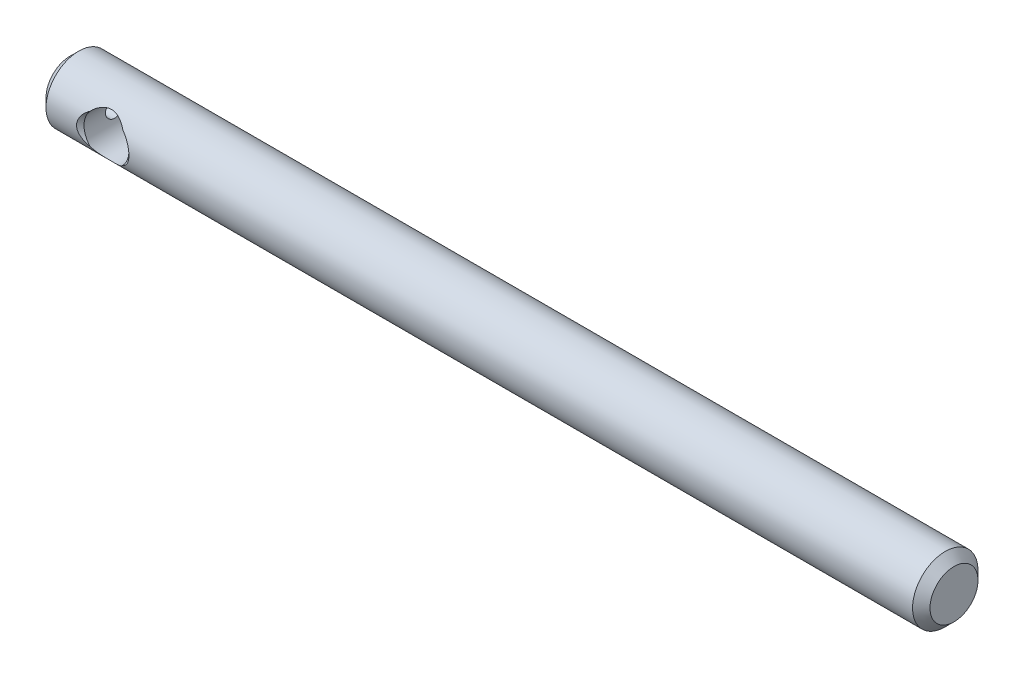
ISO-10303-21;
HEADER;
FILE_DESCRIPTION(('STEP AP214'),'2;1');
FILE_NAME('part.step','',(''),(''),'','','');
FILE_SCHEMA(('AUTOMOTIVE_DESIGN { 1 0 10303 214 1 1 1 1 }'));
ENDSEC;
DATA;
#1=APPLICATION_CONTEXT('core data for automotive mechanical design processes');
#2=APPLICATION_PROTOCOL_DEFINITION('international standard','automotive_design',2000,#1);
#3=PRODUCT_CONTEXT('',#1,'mechanical');
#4=PRODUCT('Part','Part','',(#3));
#5=PRODUCT_RELATED_PRODUCT_CATEGORY('part','',(#4));
#6=PRODUCT_DEFINITION_FORMATION('','',#4);
#7=PRODUCT_DEFINITION_CONTEXT('part definition',#1,'design');
#8=PRODUCT_DEFINITION('design','',#6,#7);
#9=PRODUCT_DEFINITION_SHAPE('','',#8);
#10=(LENGTH_UNIT() NAMED_UNIT(*) SI_UNIT(.MILLI.,.METRE.));
#11=(NAMED_UNIT(*) PLANE_ANGLE_UNIT() SI_UNIT($,.RADIAN.));
#12=(NAMED_UNIT(*) SI_UNIT($,.STERADIAN.) SOLID_ANGLE_UNIT());
#13=UNCERTAINTY_MEASURE_WITH_UNIT(LENGTH_MEASURE(1.E-05),#10,'distance_accuracy_value','');
#14=(GEOMETRIC_REPRESENTATION_CONTEXT(3) GLOBAL_UNCERTAINTY_ASSIGNED_CONTEXT((#13)) GLOBAL_UNIT_ASSIGNED_CONTEXT((#10,
#11,#12)) REPRESENTATION_CONTEXT('',''));
#15=CARTESIAN_POINT('',(0.,0.,0.));
#16=DIRECTION('',(0.,0.,1.));
#17=DIRECTION('',(1.,0.,0.));
#18=AXIS2_PLACEMENT_3D('',#15,#16,#17);
#19=CARTESIAN_POINT('',(0.,0.,0.));
#20=DIRECTION('',(1.,0.,0.));
#21=DIRECTION('',(0.,0.,-1.));
#22=AXIS2_PLACEMENT_3D('',#19,#20,#21);
#23=PLANE('',#22);
#24=CARTESIAN_POINT('',(0.,0.,0.));
#25=DIRECTION('',(1.,0.,0.));
#26=DIRECTION('',(0.,0.,-1.));
#27=AXIS2_PLACEMENT_3D('',#24,#25,#26);
#28=CIRCLE('',#27,3.49249999999994);
#29=CARTESIAN_POINT('',(0.,0.,-3.49249999999994));
#30=VERTEX_POINT('',#29);
#31=EDGE_CURVE('E172',#30,#30,#28,.F.);
#32=ORIENTED_EDGE('',*,*,#31,.T.);
#33=EDGE_LOOP('',(#32));
#34=FACE_BOUND('',#33,.T.);
#35=CARTESIAN_POINT('',(0.,0.,0.));
#36=DIRECTION('',(-1.,0.,0.));
#37=DIRECTION('',(0.,0.,1.));
#38=AXIS2_PLACEMENT_3D('',#35,#36,#37);
#39=CIRCLE('',#38,1.5875);
#40=CARTESIAN_POINT('',(0.,0.,1.5875));
#41=VERTEX_POINT('',#40);
#42=EDGE_CURVE('E200',#41,#41,#39,.T.);
#43=ORIENTED_EDGE('',*,*,#42,.F.);
#44=EDGE_LOOP('',(#43));
#45=FACE_BOUND('',#44,.T.);
#46=ADVANCED_FACE('F49',(#34,#45),#23,.F.);
#47=CARTESIAN_POINT('',(128.651,0.,0.));
#48=DIRECTION('',(-1.,0.,0.));
#49=DIRECTION('',(0.,0.,1.));
#50=AXIS2_PLACEMENT_3D('',#47,#48,#49);
#51=CYLINDRICAL_SURFACE('',#50,4.7625);
#52=CARTESIAN_POINT('',(11.922846100149,-2.21435708276691,4.2164));
#53=CARTESIAN_POINT('',(11.8593963851507,-2.28304575855669,4.18033580494722));
#54=CARTESIAN_POINT('',(11.7931871437269,-2.34883615391557,4.14363346204814));
#55=CARTESIAN_POINT('',(11.6554453977017,-2.47446195459834,4.06985668284569));
#56=CARTESIAN_POINT('',(11.5839096207442,-2.5342936455519,4.03278203011582));
#57=CARTESIAN_POINT('',(11.4350969839388,-2.64828872738355,3.95886769940015));
#58=CARTESIAN_POINT('',(11.3577726778384,-2.70239385670328,3.9220334640076));
#59=CARTESIAN_POINT('',(11.1982081699457,-2.8039907225802,3.85005466405678));
#60=CARTESIAN_POINT('',(11.1159695326934,-2.8514845480667,3.81490956810091));
#61=CARTESIAN_POINT('',(10.8950216081164,-2.96642689913845,3.72688443656107));
#62=CARTESIAN_POINT('',(10.7524574221086,-3.0283829611826,3.67625853365449));
#63=CARTESIAN_POINT('',(10.4567130929824,-3.13198686833555,3.58841407943456));
#64=CARTESIAN_POINT('',(10.3035781811195,-3.17371577420326,3.55114217113978));
#65=CARTESIAN_POINT('',(10.0141619889141,-3.22984934359262,3.50009990107455));
#66=CARTESIAN_POINT('',(9.87901968747151,-3.24752005023514,3.48355460221914));
#67=CARTESIAN_POINT('',(9.60657372860572,-3.26573038577451,3.46649530677007));
#68=CARTESIAN_POINT('',(9.46927106408931,-3.26627766706759,3.46597414904808));
#69=CARTESIAN_POINT('',(9.19682812196039,-3.25022392482608,3.48102751074769));
#70=CARTESIAN_POINT('',(9.0616848719643,-3.23364899276646,3.49657754030484));
#71=CARTESIAN_POINT('',(8.79664575810681,-3.18445797875663,3.54142841472073));
#72=CARTESIAN_POINT('',(8.66675786427301,-3.15181845318272,3.57074935307867));
#73=CARTESIAN_POINT('',(8.36988486157737,-3.05791246355705,3.65179836609711));
#74=CARTESIAN_POINT('',(8.20599065514899,-2.99060776470707,3.70778253889326));
#75=CARTESIAN_POINT('',(7.89398142893566,-2.83257936795664,3.8298640806536));
#76=CARTESIAN_POINT('',(7.74589118136443,-2.74181964529525,3.89597694218302));
#77=CARTESIAN_POINT('',(7.51947782700501,-2.57729539988316,4.00558776091318));
#78=CARTESIAN_POINT('',(7.43590920361209,-2.51003404771525,4.04820927783652));
#79=CARTESIAN_POINT('',(7.2761055379004,-2.36788121999423,4.13296225373637));
#80=CARTESIAN_POINT('',(7.19983689581187,-2.29302832970382,4.1750950869016));
#81=CARTESIAN_POINT('',(7.12715389985095,-2.21435708276691,4.2164));
#82=B_SPLINE_CURVE_WITH_KNOTS('',3,(#52,#53,#54,#55,#56,#57,#58,#59,#60,#61,#62,#63,#64,#65,#66,
#67,#68,#69,#70,#71,#72,#73,#74,#75,#76,#77,#78,#79,#80,#81),.UNSPECIFIED.,.F.,.F.,(4,2,2,2,2,2,
2,2,2,2,2,2,2,2,4),(0.,0.30057240666838,0.601331018188819,0.904903154712081,1.20837915480768,
1.6969146102825,2.1834757218994,2.59348533853288,3.00331172074826,3.41251451397409,
3.82231624972983,4.37678564380587,4.93211176632249,5.27796368440854,5.62213834558137),.UNSPECIFIED.);
#83=CARTESIAN_POINT('',(11.922846100149,-2.21435708276691,4.2164));
#84=VERTEX_POINT('',#83);
#85=CARTESIAN_POINT('',(7.12715389985095,-2.21435708276691,4.2164));
#86=VERTEX_POINT('',#85);
#87=EDGE_CURVE('E101',#84,#86,#82,.T.);
#88=ORIENTED_EDGE('',*,*,#87,.T.);
#89=CARTESIAN_POINT('',(8.90757793853357,-2.81914662962223,3.83846564797571));
#90=CARTESIAN_POINT('',(8.79106740837645,-2.80458060113342,3.84916390603148));
#91=CARTESIAN_POINT('',(8.67533703470588,-2.78588297248307,3.86277846865469));
#92=CARTESIAN_POINT('',(8.44622825969552,-2.74031671091774,3.8952330065565));
#93=CARTESIAN_POINT('',(8.3328511080855,-2.71344384926923,3.91407568569393));
#94=CARTESIAN_POINT('',(7.99694763086625,-2.62055560858735,3.97741141491382));
#95=CARTESIAN_POINT('',(7.77885777943836,-2.54229650322739,4.02869079786512));
#96=CARTESIAN_POINT('',(7.46351553749657,-2.39974217386415,4.11409056533092));
#97=CARTESIAN_POINT('',(7.35952397548273,-2.34746737269439,4.14426830402653));
#98=CARTESIAN_POINT('',(7.15687636592087,-2.23430226258242,4.20636113425489));
#99=CARTESIAN_POINT('',(7.05822152628604,-2.17341001435274,4.23827661585536));
#100=CARTESIAN_POINT('',(6.77209411130946,-1.97768848673568,4.33489664545605));
#101=CARTESIAN_POINT('',(6.5936079779569,-1.82944034695805,4.40071794104129));
#102=CARTESIAN_POINT('',(6.33713931074353,-1.56247172989335,4.50016282500026));
#103=CARTESIAN_POINT('',(6.24752318654744,-1.45568108484586,4.53612921876383));
#104=CARTESIAN_POINT('',(6.08497138494224,-1.22856593954547,4.60282274944209));
#105=CARTESIAN_POINT('',(6.0120090309261,-1.10826355080747,4.63355824501669));
#106=CARTESIAN_POINT('',(5.89809020529109,-0.877231583937831,4.68223131262798));
#107=CARTESIAN_POINT('',(5.853781718418,-0.768440236869561,4.70146262264769));
#108=CARTESIAN_POINT('',(5.78243845239669,-0.544300982720532,4.73264229237658));
#109=CARTESIAN_POINT('',(5.75539132106028,-0.428957828611541,4.74459585974));
#110=CARTESIAN_POINT('',(5.72060216568277,-0.194165580145159,4.75999999669277));
#111=CARTESIAN_POINT('',(5.71296044508726,-0.0746983748402494,4.76340638622127));
#112=CARTESIAN_POINT('',(5.71797557157861,0.163717889211004,4.76117762183344));
#113=CARTESIAN_POINT('',(5.73063180905551,0.282666963410834,4.75554273945426));
#114=CARTESIAN_POINT('',(5.77328621202589,0.506642394534393,4.73670144483795));
#115=CARTESIAN_POINT('',(5.80179657943709,0.612016048940199,4.72414532513178));
#116=CARTESIAN_POINT('',(5.87311942296365,0.816825624490935,4.69307488508336));
#117=CARTESIAN_POINT('',(5.91593753983042,0.916259185533052,4.67455821493265));
#118=CARTESIAN_POINT('',(6.03400836995725,1.14759495686977,4.62424700602127));
#119=CARTESIAN_POINT('',(6.11534935915909,1.27588361667324,4.59012965167193));
#120=CARTESIAN_POINT('',(6.29672297826325,1.51670150530158,4.51630179636163));
#121=CARTESIAN_POINT('',(6.39679943204449,1.62919268016438,4.47657823674379));
#122=CARTESIAN_POINT('',(6.65209880612282,1.87835759457933,4.37918572779586));
#123=CARTESIAN_POINT('',(6.81381476410978,2.00794308789971,4.32044038693387));
#124=CARTESIAN_POINT('',(7.15687624821052,2.23893097232324,4.20538424922484));
#125=CARTESIAN_POINT('',(7.33824461336457,2.34030007297322,4.14907639374711));
#126=CARTESIAN_POINT('',(7.72070357060016,2.51830974331137,4.04357535132911));
#127=CARTESIAN_POINT('',(7.92217513003681,2.59426519205241,3.99459640755657));
#128=CARTESIAN_POINT('',(8.23268035887299,2.68702803363707,3.93225727132933));
#129=CARTESIAN_POINT('',(8.33757458020784,2.7144220558186,3.91333127567738));
#130=CARTESIAN_POINT('',(8.54963098316964,2.76212318481161,3.87981168617045));
#131=CARTESIAN_POINT('',(8.65679237385253,2.78243272130545,3.86521660724906));
#132=CARTESIAN_POINT('',(8.88331999646291,2.81753165313805,3.83971873400111));
#133=CARTESIAN_POINT('',(9.00285683887617,2.8315890493981,3.82931517692259));
#134=CARTESIAN_POINT('',(9.24302714700901,2.85100028030227,3.81488546901932));
#135=CARTESIAN_POINT('',(9.3636606658709,2.85635369088717,3.81085962891794));
#136=CARTESIAN_POINT('',(9.60501575211909,2.85831566543433,3.80938834262644));
#137=CARTESIAN_POINT('',(9.7257372971171,2.8549259751524,3.81194158277557));
#138=CARTESIAN_POINT('',(9.96630000042284,2.83943170575494,3.82349655839155));
#139=CARTESIAN_POINT('',(10.0861411910958,2.82732744865673,3.83249805558484));
#140=CARTESIAN_POINT('',(10.3166621079365,2.79549786829503,3.8557697760723));
#141=CARTESIAN_POINT('',(10.4274500066965,2.77629024536124,3.86967967068664));
#142=CARTESIAN_POINT('',(10.6467604038374,2.73035429564902,3.90222427188532));
#143=CARTESIAN_POINT('',(10.7552818911146,2.70362268609715,3.92086104048951));
#144=CARTESIAN_POINT('',(11.0768290126512,2.61213165633669,3.98292372741341));
#145=CARTESIAN_POINT('',(11.2856634726761,2.5360999056252,4.03248272704616));
#146=CARTESIAN_POINT('',(11.5925844214243,2.39678067578893,4.11582093900066));
#147=CARTESIAN_POINT('',(11.6966870572993,2.3442327321016,4.14610371473533));
#148=CARTESIAN_POINT('',(11.8995173006829,2.23048291854163,4.20839218400429));
#149=CARTESIAN_POINT('',(11.9982435295559,2.16927884337318,4.24039831530171));
#150=CARTESIAN_POINT('',(12.2845380757109,1.97254043417229,4.33726470574129));
#151=CARTESIAN_POINT('',(12.4630491692057,1.82351489907142,4.40320997069355));
#152=CARTESIAN_POINT('',(12.7187932611042,1.55566445738261,4.5025195207368));
#153=CARTESIAN_POINT('',(12.8078396242737,1.4488926666274,4.5382990572157));
#154=CARTESIAN_POINT('',(12.9692628028756,1.22190566137549,4.60459225022133));
#155=CARTESIAN_POINT('',(13.0416667613823,1.10171281876056,4.63511446055254));
#156=CARTESIAN_POINT('',(13.1546781962743,0.870825550170116,4.6834267208862));
#157=CARTESIAN_POINT('',(13.1986097839898,0.762039924801345,4.70250279733239));
#158=CARTESIAN_POINT('',(13.2692003865232,0.537977449583431,4.73336387632051));
#159=CARTESIAN_POINT('',(13.2958716017266,0.422705247512862,4.7451540286055));
#160=CARTESIAN_POINT('',(13.3299345428874,0.188140495830151,4.76023879068693));
#161=CARTESIAN_POINT('',(13.3372278280879,0.068830524925416,4.76349002141992));
#162=CARTESIAN_POINT('',(13.331582049552,-0.169207882154685,4.76098106030375));
#163=CARTESIAN_POINT('',(13.318643341407,-0.287936328513958,4.75522102683382));
#164=CARTESIAN_POINT('',(13.2754969117669,-0.511620188089974,4.73616533163596));
#165=CARTESIAN_POINT('',(13.2467454336742,-0.616919745613378,4.72350584857322));
#166=CARTESIAN_POINT('',(13.1749722166696,-0.821552794991215,4.69224806523511));
#167=CARTESIAN_POINT('',(13.1319448515808,-0.920883916406098,4.67364742363645));
#168=CARTESIAN_POINT('',(13.0132687801218,-1.1522282140502,4.62309922599926));
#169=CARTESIAN_POINT('',(12.9314993371839,-1.2805914267425,4.58882070386572));
#170=CARTESIAN_POINT('',(12.7492584149673,-1.52148939088488,4.51469336897146));
#171=CARTESIAN_POINT('',(12.6487429468235,-1.63398579628532,4.4748315104499));
#172=CARTESIAN_POINT('',(12.3924292528058,-1.88306236961289,4.37716454318029));
#173=CARTESIAN_POINT('',(12.2301428005514,-2.01253596574607,4.31829985237851));
#174=CARTESIAN_POINT('',(11.8859411351527,-2.2432208347712,4.20309434479735));
#175=CARTESIAN_POINT('',(11.7040028323141,-2.3443983496349,4.1467566094266));
#176=CARTESIAN_POINT('',(11.3204184945204,-2.52191858675782,4.04131956194357));
#177=CARTESIAN_POINT('',(11.1183936299493,-2.5975776320534,3.99243627726741));
#178=CARTESIAN_POINT('',(10.8070977008541,-2.68981615681758,3.93034869484701));
#179=CARTESIAN_POINT('',(10.7019541533932,-2.71702093083074,3.91152550741485));
#180=CARTESIAN_POINT('',(10.4894123134842,-2.76431879076288,3.87824598167919));
#181=CARTESIAN_POINT('',(10.3820148561514,-2.78441446312235,3.86378805548305));
#182=CARTESIAN_POINT('',(10.1613506831524,-2.81807213336412,3.83931324398566));
#183=CARTESIAN_POINT('',(10.0480185578867,-2.83134830135868,3.82949185985154));
#184=CARTESIAN_POINT('',(9.82035577277732,-2.85007829359716,3.81557300902968));
#185=CARTESIAN_POINT('',(9.7060251102109,-2.85553209650423,3.81147555795495));
#186=CARTESIAN_POINT('',(9.47721299593673,-2.85858033142155,3.80919004033268));
#187=CARTESIAN_POINT('',(9.36273156499871,-2.85617575166524,3.81100123074197));
#188=CARTESIAN_POINT('',(9.13444781483653,-2.84352679120398,3.82044790594498));
#189=CARTESIAN_POINT('',(9.02064551190753,-2.83328222314073,3.82808352992971));
#190=CARTESIAN_POINT('',(8.90757793853357,-2.81914662962223,3.83846564797571));
#191=B_SPLINE_CURVE_WITH_KNOTS('',3,(#89,#90,#91,#92,#93,#94,#95,#96,#97,#98,#99,#100,#101,#102,
#103,#104,#105,#106,#107,#108,#109,#110,#111,#112,#113,#114,#115,#116,#117,#118,#119,#120,#121,
#122,#123,#124,#125,#126,#127,#128,#129,#130,#131,#132,#133,#134,#135,#136,#137,#138,#139,#140,
#141,#142,#143,#144,#145,#146,#147,#148,#149,#150,#151,#152,#153,#154,#155,#156,#157,#158,#159,
#160,#161,#162,#163,#164,#165,#166,#167,#168,#169,#170,#171,#172,#173,#174,#175,#176,#177,#178,
#179,#180,#181,#182,#183,#184,#185,#186,#187,#188,#189,#190),.UNSPECIFIED.,.T.,.F.,(4,2,2,2,2,2,
2,2,2,2,2,2,2,2,2,2,2,2,2,2,2,2,2,2,2,2,2,2,2,2,2,2,2,2,2,2,2,2,2,2,2,2,2,2,2,2,2,2,2,2,4),(0.,
0.35359600560095,0.707375224698357,1.41555979302878,1.77591421470827,2.13634986060387,
2.85437461199381,3.28501867272207,3.71496799405631,4.07061935016314,4.42601591672143,
4.78324576602002,5.14046488681108,5.46874807365196,5.79716083733087,6.26162243651195,
6.72718434219803,7.36991689381133,8.01340457492976,8.67305612470866,9.00293936415512,
9.33270935595358,9.69465688534931,10.0566220483431,10.4185149424843,10.7803944647854,
11.1198904095275,11.4595347091978,12.1393471635079,12.5004137213301,12.8615724332209,
13.5811208383612,14.0105241975651,14.4392221680936,14.7943628156429,15.1492521592882,
15.5059409401355,15.8626234519997,16.1909205276235,16.5193471402604,16.9847655588111,
17.4512901786578,18.0951998574244,18.7398744931465,19.4006567470245,19.7310587535181,
20.061340428897,20.4045214769221,20.7477034610308,21.0908422898398,21.4339893191607),.UNSPECIFIED.);
#192=CARTESIAN_POINT('',(7.12715389985095,2.21435708276691,4.2164));
#193=VERTEX_POINT('',#192);
#194=EDGE_CURVE('E104',#86,#193,#191,.T.);
#195=ORIENTED_EDGE('',*,*,#194,.T.);
#196=CARTESIAN_POINT('',(7.12715389985095,2.21435708276691,4.2164));
#197=CARTESIAN_POINT('',(7.19060361484935,2.28304575855669,4.18033580494722));
#198=CARTESIAN_POINT('',(7.2568128562731,2.34883615391557,4.14363346204814));
#199=CARTESIAN_POINT('',(7.39455460229833,2.47446195459834,4.06985668284569));
#200=CARTESIAN_POINT('',(7.46609037925584,2.5342936455519,4.03278203011582));
#201=CARTESIAN_POINT('',(7.61490301606124,2.64828872738354,3.95886769940015));
#202=CARTESIAN_POINT('',(7.69222732216156,2.70239385670327,3.92203346400761));
#203=CARTESIAN_POINT('',(7.8517918300543,2.8039907225802,3.85005466405679));
#204=CARTESIAN_POINT('',(7.93403046730662,2.85148454806669,3.81490956810091));
#205=CARTESIAN_POINT('',(8.15497839188361,2.96642689913845,3.72688443656108));
#206=CARTESIAN_POINT('',(8.29754257789139,3.02838296118259,3.6762585336545));
#207=CARTESIAN_POINT('',(8.59328690701762,3.13198686833554,3.58841407943457));
#208=CARTESIAN_POINT('',(8.74642181888046,3.17371577420326,3.55114217113978));
#209=CARTESIAN_POINT('',(9.03583801108589,3.22984934359262,3.50009990107455));
#210=CARTESIAN_POINT('',(9.17098031252848,3.24752005023514,3.48355460221915));
#211=CARTESIAN_POINT('',(9.44342627139426,3.26573038577451,3.46649530677007));
#212=CARTESIAN_POINT('',(9.58072893591067,3.26627766706759,3.46597414904808));
#213=CARTESIAN_POINT('',(9.85317187803959,3.25022392482608,3.48102751074768));
#214=CARTESIAN_POINT('',(9.98831512803568,3.23364899276646,3.49657754030484));
#215=CARTESIAN_POINT('',(10.2533542418932,3.18445797875663,3.54142841472073));
#216=CARTESIAN_POINT('',(10.383242135727,3.15181845318272,3.57074935307866));
#217=CARTESIAN_POINT('',(10.6801151384226,3.05791246355705,3.65179836609711));
#218=CARTESIAN_POINT('',(10.844009344851,2.99060776470708,3.70778253889325));
#219=CARTESIAN_POINT('',(11.1560185710643,2.83257936795664,3.8298640806536));
#220=CARTESIAN_POINT('',(11.3041088186356,2.74181964529526,3.89597694218302));
#221=CARTESIAN_POINT('',(11.530522172995,2.57729539988316,4.00558776091317));
#222=CARTESIAN_POINT('',(11.6140907963879,2.51003404771525,4.04820927783652));
#223=CARTESIAN_POINT('',(11.7738944620996,2.36788121999424,4.13296225373637));
#224=CARTESIAN_POINT('',(11.8501631041881,2.29302832970383,4.1750950869016));
#225=CARTESIAN_POINT('',(11.922846100149,2.21435708276691,4.2164));
#226=B_SPLINE_CURVE_WITH_KNOTS('',3,(#196,#197,#198,#199,#200,#201,#202,#203,#204,#205,#206,
#207,#208,#209,#210,#211,#212,#213,#214,#215,#216,#217,#218,#219,#220,#221,#222,#223,#224,#225),
.UNSPECIFIED.,.F.,.F.,(4,2,2,2,2,2,2,2,2,2,2,2,2,2,4),(0.,0.300572406668378,0.601331018188814,
0.904903154712073,1.20837915480766,1.69691461028248,2.18347572189938,2.59348533853286,
3.00331172074824,3.41251451397407,3.82231624972981,4.37678564380585,4.93211176632248,
5.27796368440853,5.62213834558137),.UNSPECIFIED.);
#227=CARTESIAN_POINT('',(11.922846100149,2.21435708276691,4.2164));
#228=VERTEX_POINT('',#227);
#229=EDGE_CURVE('E108',#193,#228,#226,.T.);
#230=ORIENTED_EDGE('',*,*,#229,.T.);
#231=EDGE_CURVE('E96',#228,#84,#191,.T.);
#232=ORIENTED_EDGE('',*,*,#231,.T.);
#233=EDGE_LOOP('',(#88,#195,#230,#232));
#234=FACE_BOUND('',#233,.T.);
#235=CARTESIAN_POINT('',(8.90757793853357,-2.81914662962224,-3.83846564797571));
#236=CARTESIAN_POINT('',(9.01931847294668,-2.83311617690434,-3.82820559518202));
#237=CARTESIAN_POINT('',(9.13177869200754,-2.84328593916273,-3.82062724057579));
#238=CARTESIAN_POINT('',(9.35737133412407,-2.85596843682539,-3.81115659813294));
#239=CARTESIAN_POINT('',(9.47050374568209,-2.85848130282285,-3.80926421331853));
#240=CARTESIAN_POINT('',(9.69660750429966,-2.85583299282743,-3.81125001674514));
#241=CARTESIAN_POINT('',(9.8095788762038,-2.85067316749172,-3.815127189346));
#242=CARTESIAN_POINT('',(10.0345758818546,-2.83271622773458,-3.82847863414229));
#243=CARTESIAN_POINT('',(10.1466014979664,-2.81991897122191,-3.83795301047135));
#244=CARTESIAN_POINT('',(10.3689565435088,-2.78675488575051,-3.86210109722629));
#245=CARTESIAN_POINT('',(10.4792860598135,-2.76638844583933,-3.87677454042415));
#246=CARTESIAN_POINT('',(10.6975842929688,-2.71816550459009,-3.91073423693953));
#247=CARTESIAN_POINT('',(10.8055519050462,-2.69030557591108,-3.93002260056326));
#248=CARTESIAN_POINT('',(11.1253579935902,-2.5954506516716,-3.99386109896251));
#249=CARTESIAN_POINT('',(11.3328773630428,-2.51721347223129,-4.04435819624736));
#250=CARTESIAN_POINT('',(11.637947531446,-2.37432807555945,-4.12883367742448));
#251=CARTESIAN_POINT('',(11.7416111896396,-2.32038567610272,-4.15951900531447));
#252=CARTESIAN_POINT('',(11.9434059043296,-2.20376637373798,-4.22246603626488));
#253=CARTESIAN_POINT('',(12.0415354329702,-2.14108707517768,-4.25472817010359));
#254=CARTESIAN_POINT('',(12.3257027052352,-1.93981002946505,-4.35209756470947));
#255=CARTESIAN_POINT('',(12.5024090199489,-1.78756830659937,-4.41804775458016));
#256=CARTESIAN_POINT('',(12.7524384827458,-1.51624733312868,-4.51594070356476));
#257=CARTESIAN_POINT('',(12.8382630818705,-1.4095593068006,-4.55065298011857));
#258=CARTESIAN_POINT('',(12.9933070172488,-1.18322784020771,-4.6146664349011));
#259=CARTESIAN_POINT('',(13.0625530904203,-1.06360571791554,-4.64397630801082));
#260=CARTESIAN_POINT('',(13.170374340574,-0.833482194937769,-4.69021511211204));
#261=CARTESIAN_POINT('',(13.2121243689573,-0.724730174937116,-4.70838872172338));
#262=CARTESIAN_POINT('',(13.2783585919664,-0.501118348615069,-4.73739978171338));
#263=CARTESIAN_POINT('',(13.3028546002425,-0.386262779390448,-4.74824225144407));
#264=CARTESIAN_POINT('',(13.3327207567899,-0.153023536501003,-4.76147884922919));
#265=CARTESIAN_POINT('',(13.3380029119929,-0.0346261283763546,-4.76383410821775));
#266=CARTESIAN_POINT('',(13.3287182061001,0.201225840491847,-4.75970880065398));
#267=CARTESIAN_POINT('',(13.3141502989774,0.318680351220009,-4.75322776846088));
#268=CARTESIAN_POINT('',(13.2681442381939,0.540698393821584,-4.73292824395663));
#269=CARTESIAN_POINT('',(13.2379800840657,0.645584539536142,-4.71966459225107));
#270=CARTESIAN_POINT('',(13.1635613784389,0.849225771718561,-4.68730979642867));
#271=CARTESIAN_POINT('',(13.1193012346322,0.947978406222463,-4.66821633957506));
#272=CARTESIAN_POINT('',(12.9970436258143,1.17938949168012,-4.61627147507207));
#273=CARTESIAN_POINT('',(12.9127389855869,1.30818286113606,-4.58104437517976));
#274=CARTESIAN_POINT('',(12.7253655865584,1.54953452027308,-4.50515817360598));
#275=CARTESIAN_POINT('',(12.6222517312709,1.6620526005053,-4.46448608089247));
#276=CARTESIAN_POINT('',(12.3599667294314,1.91055737411652,-4.36523095712021));
#277=CARTESIAN_POINT('',(12.194340270101,2.03933529198465,-4.30568958249035));
#278=CARTESIAN_POINT('',(11.843490365215,2.26815019483404,-4.18967349276031));
#279=CARTESIAN_POINT('',(11.6582450539721,2.36815463994263,-4.13320230778733));
#280=CARTESIAN_POINT('',(11.2682386564293,2.54266924056577,-4.02825835681071));
#281=CARTESIAN_POINT('',(11.0631187550968,2.61651804719952,-3.98000721257399));
#282=CARTESIAN_POINT('',(10.7473278033321,2.70562584671158,-3.91947118471039));
#283=CARTESIAN_POINT('',(10.6407062490399,2.73171837934474,-3.90126528492685));
#284=CARTESIAN_POINT('',(10.4252856523337,2.77664393992277,-3.86942127134571));
#285=CARTESIAN_POINT('',(10.3164874019162,2.79547955954108,-3.85578152705794));
#286=CARTESIAN_POINT('',(10.0883385175136,2.82706923507511,-3.83268859460309));
#287=CARTESIAN_POINT('',(9.96885606115192,2.83919555300109,-3.82367209811048));
#288=CARTESIAN_POINT('',(9.72900864335451,2.85478507084073,-3.81204723022825));
#289=CARTESIAN_POINT('',(9.6086436437394,2.85824789372159,-3.8094391377306));
#290=CARTESIAN_POINT('',(9.36802963112389,2.85648329364814,-3.81076246433548));
#291=CARTESIAN_POINT('',(9.24778060475313,2.85125703402887,-3.81469300801483));
#292=CARTESIAN_POINT('',(9.00835798445945,2.83215576952805,-3.82889541034636));
#293=CARTESIAN_POINT('',(8.88918435960329,2.81828101422467,-3.83916708600616));
#294=CARTESIAN_POINT('',(8.65982088408368,2.78304389384521,-3.86477906173878));
#295=CARTESIAN_POINT('',(8.54951742015857,2.76217442610794,-3.87978260905761));
#296=CARTESIAN_POINT('',(8.33131788030517,2.71293551117835,-3.91436879877143));
#297=CARTESIAN_POINT('',(8.22342287860204,2.68456278709772,-3.93395344143014));
#298=CARTESIAN_POINT('',(7.90392356288559,2.58815631379974,-3.99861414874124));
#299=CARTESIAN_POINT('',(7.69670317141343,2.50886451732124,-4.04957278116895));
#300=CARTESIAN_POINT('',(7.39221082603138,2.36428843277948,-4.13459949206271));
#301=CARTESIAN_POINT('',(7.28875941611173,2.30973660598271,-4.16545150302688));
#302=CARTESIAN_POINT('',(7.08745916539461,2.19186473000601,-4.22866610513968));
#303=CARTESIAN_POINT('',(6.9896118931588,2.12854224276423,-4.26102911465057));
#304=CARTESIAN_POINT('',(6.70643645992623,1.92528600305049,-4.35858426884854));
#305=CARTESIAN_POINT('',(6.53056185015529,1.7716427217613,-4.42451134968143));
#306=CARTESIAN_POINT('',(6.28306074789044,1.49881487594936,-4.52175414130855));
#307=CARTESIAN_POINT('',(6.19862837173146,1.39216009450346,-4.55599905728544));
#308=CARTESIAN_POINT('',(6.04634433259051,1.16610556320566,-4.61901603771774));
#309=CARTESIAN_POINT('',(5.97846611299279,1.04672667384078,-4.64779685117538));
#310=CARTESIAN_POINT('',(5.87290703943275,0.816927340261564,-4.69312638448893));
#311=CARTESIAN_POINT('',(5.83211548252511,0.708189062941152,-4.71090142437916));
#312=CARTESIAN_POINT('',(5.76779494033797,0.484774202032106,-4.73909665507774));
#313=CARTESIAN_POINT('',(5.74425431314203,0.370101679267301,-4.74952180583211));
#314=CARTESIAN_POINT('',(5.71622973546405,0.137443908260302,-4.76194614650462));
#315=CARTESIAN_POINT('',(5.71182922896505,0.0194464072977923,-4.76390844112648));
#316=CARTESIAN_POINT('',(5.7227095447048,-0.215449704116276,-4.75907468967421));
#317=CARTESIAN_POINT('',(5.73799198773716,-0.332348223273638,-4.75227792233457));
#318=CARTESIAN_POINT('',(5.78526474984754,-0.553647814313749,-4.73142871188559));
#319=CARTESIAN_POINT('',(5.81606060612862,-0.658360358176875,-4.71789571041343));
#320=CARTESIAN_POINT('',(5.8916659560298,-0.861581198134611,-4.68505077893767));
#321=CARTESIAN_POINT('',(5.93648106330026,-0.960086989877352,-4.665736534117));
#322=CARTESIAN_POINT('',(6.060360092076,-1.19153826471929,-4.61316259784284));
#323=CARTESIAN_POINT('',(6.14581278304139,-1.32052139925918,-4.57750879104246));
#324=CARTESIAN_POINT('',(6.3355085144601,-1.56206630169193,-4.50083431418327));
#325=CARTESIAN_POINT('',(6.43979678398877,-1.67458733619189,-4.45980079251342));
#326=CARTESIAN_POINT('',(6.70474942242691,-1.92279038479246,-4.35985386346957));
#327=CARTESIAN_POINT('',(6.87184966469105,-2.05122398434073,-4.30002916821915));
#328=CARTESIAN_POINT('',(7.22564247235441,-2.27915451656618,-4.18368741313908));
#329=CARTESIAN_POINT('',(7.41235870777941,-2.37861593079643,-4.12717448056675));
#330=CARTESIAN_POINT('',(7.81043783701301,-2.554047138406,-4.02110677437433));
#331=CARTESIAN_POINT('',(8.02256590433795,-2.62859575683899,-3.97204041441384));
#332=CARTESIAN_POINT('',(8.34909452517217,-2.71739119236723,-3.91132218651059));
#333=CARTESIAN_POINT('',(8.45932435719848,-2.74315144895171,-3.89322991327533));
#334=CARTESIAN_POINT('',(8.68198334536089,-2.78695364611098,-3.86199817052298));
#335=CARTESIAN_POINT('',(8.79441155761537,-2.80499882625541,-3.84885662246666));
#336=CARTESIAN_POINT('',(8.90757793853357,-2.81914662962224,-3.83846564797571));
#337=B_SPLINE_CURVE_WITH_KNOTS('',3,(#235,#236,#237,#238,#239,#240,#241,#242,#243,#244,#245,
#246,#247,#248,#249,#250,#251,#252,#253,#254,#255,#256,#257,#258,#259,#260,#261,#262,#263,#264,
#265,#266,#267,#268,#269,#270,#271,#272,#273,#274,#275,#276,#277,#278,#279,#280,#281,#282,#283,
#284,#285,#286,#287,#288,#289,#290,#291,#292,#293,#294,#295,#296,#297,#298,#299,#300,#301,#302,
#303,#304,#305,#306,#307,#308,#309,#310,#311,#312,#313,#314,#315,#316,#317,#318,#319,#320,#321,
#322,#323,#324,#325,#326,#327,#328,#329,#330,#331,#332,#333,#334,#335,#336),.UNSPECIFIED.,.T.,
.F.,(4,2,2,2,2,2,2,2,2,2,2,2,2,2,2,2,2,2,2,2,2,2,2,2,2,2,2,2,2,2,2,2,2,2,2,2,2,2,2,2,2,2,2,2,2,
2,2,2,2,2,4),(0.,0.339125816408684,0.678245848780317,1.01730619144613,1.35637284238504,
1.69542206808748,2.03462663120118,2.7137075290629,3.0757810290668,3.43795400541477,
4.15930297331421,4.58180494843172,5.00362087550284,5.355870710314,5.70787912821858,
6.06149761247165,6.41513473186742,6.74361180143986,7.07221935053851,7.54331280604252,
8.01555095418741,8.66631718482099,9.31781649895772,9.98477708956057,10.3182938715255,
10.6516914334324,11.0125147664755,11.3733538021727,11.7341445309408,12.0949248484973,
12.4343072732507,12.7738381615677,13.4534994354768,13.815970639586,14.1785428061577,
14.9006049844637,15.3201673957387,15.7390522398946,16.0900713206768,16.440853294955,
16.7931630282417,17.1455017743487,17.4741130247718,17.8028560279585,18.2765292207706,
18.7513553242567,19.4050953891074,20.059633565591,20.7468583265878,21.0904559206438,
21.4339090956306),.UNSPECIFIED.);
#338=CARTESIAN_POINT('',(11.922846100149,-2.21435708276692,-4.2164));
#339=VERTEX_POINT('',#338);
#340=CARTESIAN_POINT('',(11.922846100149,2.21435708276692,-4.2164));
#341=VERTEX_POINT('',#340);
#342=EDGE_CURVE('E64',#339,#341,#337,.T.);
#343=ORIENTED_EDGE('',*,*,#342,.T.);
#344=CARTESIAN_POINT('',(11.922846100149,2.21435708276692,-4.2164));
#345=CARTESIAN_POINT('',(11.8593963851507,2.2830457585567,-4.18033580494721));
#346=CARTESIAN_POINT('',(11.7931871437269,2.34883615391558,-4.14363346204814));
#347=CARTESIAN_POINT('',(11.6554453977017,2.47446195459834,-4.06985668284569));
#348=CARTESIAN_POINT('',(11.5839096207442,2.5342936455519,-4.03278203011582));
#349=CARTESIAN_POINT('',(11.4350969839388,2.64828872738355,-3.95886769940015));
#350=CARTESIAN_POINT('',(11.3577726778384,2.70239385670328,-3.9220334640076));
#351=CARTESIAN_POINT('',(11.1982081699457,2.8039907225802,-3.85005466405678));
#352=CARTESIAN_POINT('',(11.1159695326934,2.8514845480667,-3.81490956810091));
#353=CARTESIAN_POINT('',(10.8950216081164,2.96642689913845,-3.72688443656107));
#354=CARTESIAN_POINT('',(10.7524574221086,3.0283829611826,-3.67625853365449));
#355=CARTESIAN_POINT('',(10.4567130929824,3.13198686833555,-3.58841407943456));
#356=CARTESIAN_POINT('',(10.3035781811195,3.17371577420326,-3.55114217113978));
#357=CARTESIAN_POINT('',(10.0141619889141,3.22984934359262,-3.50009990107455));
#358=CARTESIAN_POINT('',(9.87901968747151,3.24752005023514,-3.48355460221914));
#359=CARTESIAN_POINT('',(9.60657372860572,3.26573038577451,-3.46649530677007));
#360=CARTESIAN_POINT('',(9.46927106408931,3.26627766706759,-3.46597414904808));
#361=CARTESIAN_POINT('',(9.19682812196039,3.25022392482608,-3.48102751074768));
#362=CARTESIAN_POINT('',(9.0616848719643,3.23364899276646,-3.49657754030484));
#363=CARTESIAN_POINT('',(8.79664575810681,3.18445797875663,-3.54142841472073));
#364=CARTESIAN_POINT('',(8.66675786427301,3.15181845318272,-3.57074935307867));
#365=CARTESIAN_POINT('',(8.36988486157737,3.05791246355705,-3.65179836609711));
#366=CARTESIAN_POINT('',(8.20599065514899,2.99060776470707,-3.70778253889326));
#367=CARTESIAN_POINT('',(7.89398142893566,2.83257936795664,-3.8298640806536));
#368=CARTESIAN_POINT('',(7.74589118136443,2.74181964529525,-3.89597694218302));
#369=CARTESIAN_POINT('',(7.51947782700501,2.57729539988316,-4.00558776091318));
#370=CARTESIAN_POINT('',(7.43590920361209,2.51003404771525,-4.04820927783652));
#371=CARTESIAN_POINT('',(7.2761055379004,2.36788121999423,-4.13296225373637));
#372=CARTESIAN_POINT('',(7.19983689581187,2.29302832970383,-4.1750950869016));
#373=CARTESIAN_POINT('',(7.12715389985096,2.21435708276692,-4.2164));
#374=B_SPLINE_CURVE_WITH_KNOTS('',3,(#344,#345,#346,#347,#348,#349,#350,#351,#352,#353,#354,
#355,#356,#357,#358,#359,#360,#361,#362,#363,#364,#365,#366,#367,#368,#369,#370,#371,#372,#373),
.UNSPECIFIED.,.F.,.F.,(4,2,2,2,2,2,2,2,2,2,2,2,2,2,4),(0.,0.300572406668381,0.601331018188819,
0.90490315471208,1.20837915480767,1.69691461028249,2.18347572189939,2.59348533853287,
3.00331172074825,3.41251451397409,3.82231624972982,4.37678564380586,4.93211176632249,
5.27796368440853,5.62213834558136),.UNSPECIFIED.);
#375=CARTESIAN_POINT('',(7.12715389985096,2.21435708276692,-4.2164));
#376=VERTEX_POINT('',#375);
#377=EDGE_CURVE('E11',#341,#376,#374,.T.);
#378=ORIENTED_EDGE('',*,*,#377,.T.);
#379=CARTESIAN_POINT('',(7.12715389985096,-2.21435708276692,-4.2164));
#380=VERTEX_POINT('',#379);
#381=EDGE_CURVE('E152',#376,#380,#337,.T.);
#382=ORIENTED_EDGE('',*,*,#381,.T.);
#383=CARTESIAN_POINT('',(7.12715389985096,-2.21435708276692,-4.2164));
#384=CARTESIAN_POINT('',(7.19060361484935,-2.2830457585567,-4.18033580494721));
#385=CARTESIAN_POINT('',(7.2568128562731,-2.34883615391558,-4.14363346204814));
#386=CARTESIAN_POINT('',(7.39455460229834,-2.47446195459834,-4.06985668284569));
#387=CARTESIAN_POINT('',(7.46609037925584,-2.5342936455519,-4.03278203011582));
#388=CARTESIAN_POINT('',(7.61490301606124,-2.64828872738355,-3.95886769940015));
#389=CARTESIAN_POINT('',(7.69222732216156,-2.70239385670328,-3.92203346400761));
#390=CARTESIAN_POINT('',(7.8517918300543,-2.8039907225802,-3.85005466405678));
#391=CARTESIAN_POINT('',(7.93403046730662,-2.85148454806669,-3.81490956810091));
#392=CARTESIAN_POINT('',(8.15497839188361,-2.96642689913845,-3.72688443656108));
#393=CARTESIAN_POINT('',(8.29754257789139,-3.0283829611826,-3.6762585336545));
#394=CARTESIAN_POINT('',(8.59328690701763,-3.13198686833555,-3.58841407943457));
#395=CARTESIAN_POINT('',(8.74642181888047,-3.17371577420326,-3.55114217113978));
#396=CARTESIAN_POINT('',(9.03583801108589,-3.22984934359262,-3.50009990107455));
#397=CARTESIAN_POINT('',(9.17098031252849,-3.24752005023514,-3.48355460221915));
#398=CARTESIAN_POINT('',(9.44342627139427,-3.26573038577451,-3.46649530677007));
#399=CARTESIAN_POINT('',(9.58072893591067,-3.26627766706759,-3.46597414904808));
#400=CARTESIAN_POINT('',(9.85317187803959,-3.25022392482608,-3.48102751074768));
#401=CARTESIAN_POINT('',(9.98831512803569,-3.23364899276646,-3.49657754030484));
#402=CARTESIAN_POINT('',(10.2533542418932,-3.18445797875663,-3.54142841472073));
#403=CARTESIAN_POINT('',(10.383242135727,-3.15181845318272,-3.57074935307866));
#404=CARTESIAN_POINT('',(10.6801151384226,-3.05791246355705,-3.65179836609711));
#405=CARTESIAN_POINT('',(10.844009344851,-2.99060776470707,-3.70778253889325));
#406=CARTESIAN_POINT('',(11.1560185710643,-2.83257936795664,-3.8298640806536));
#407=CARTESIAN_POINT('',(11.3041088186356,-2.74181964529525,-3.89597694218302));
#408=CARTESIAN_POINT('',(11.530522172995,-2.57729539988316,-4.00558776091317));
#409=CARTESIAN_POINT('',(11.6140907963879,-2.51003404771525,-4.04820927783652));
#410=CARTESIAN_POINT('',(11.7738944620996,-2.36788121999423,-4.13296225373637));
#411=CARTESIAN_POINT('',(11.8501631041881,-2.29302832970383,-4.1750950869016));
#412=CARTESIAN_POINT('',(11.922846100149,-2.21435708276692,-4.2164));
#413=B_SPLINE_CURVE_WITH_KNOTS('',3,(#383,#384,#385,#386,#387,#388,#389,#390,#391,#392,#393,
#394,#395,#396,#397,#398,#399,#400,#401,#402,#403,#404,#405,#406,#407,#408,#409,#410,#411,#412),
.UNSPECIFIED.,.F.,.F.,(4,2,2,2,2,2,2,2,2,2,2,2,2,2,4),(0.,0.300572406668378,0.601331018188813,
0.904903154712073,1.20837915480766,1.69691461028248,2.18347572189938,2.59348533853286,
3.00331172074824,3.41251451397407,3.82231624972981,4.37678564380585,4.93211176632248,
5.27796368440853,5.62213834558136),.UNSPECIFIED.);
#414=EDGE_CURVE('E117',#380,#339,#413,.T.);
#415=ORIENTED_EDGE('',*,*,#414,.T.);
#416=EDGE_LOOP('',(#343,#378,#382,#415));
#417=FACE_BOUND('',#416,.T.);
#418=CARTESIAN_POINT('',(1.27000000000005,0.,0.));
#419=DIRECTION('',(1.,0.,0.));
#420=DIRECTION('',(0.,0.,-1.));
#421=AXIS2_PLACEMENT_3D('',#418,#419,#420);
#422=CIRCLE('',#421,4.7625);
#423=CARTESIAN_POINT('',(1.27000000000005,0.,-4.7625));
#424=VERTEX_POINT('',#423);
#425=EDGE_CURVE('E166',#424,#424,#422,.T.);
#426=ORIENTED_EDGE('',*,*,#425,.T.);
#427=EDGE_LOOP('',(#426));
#428=FACE_BOUND('',#427,.T.);
#429=CARTESIAN_POINT('',(127.381,0.,0.));
#430=DIRECTION('',(1.,0.,0.));
#431=DIRECTION('',(0.,0.,-1.));
#432=AXIS2_PLACEMENT_3D('',#429,#430,#431);
#433=CIRCLE('',#432,4.7625);
#434=CARTESIAN_POINT('',(127.381,0.,4.76250000000001));
#435=VERTEX_POINT('',#434);
#436=EDGE_CURVE('E163',#435,#435,#433,.F.);
#437=ORIENTED_EDGE('',*,*,#436,.T.);
#438=EDGE_LOOP('',(#437));
#439=FACE_BOUND('',#438,.T.);
#440=ADVANCED_FACE('F114',(#234,#417,#428,#439),#51,.T.);
#441=CARTESIAN_POINT('',(128.651,0.,0.));
#442=DIRECTION('',(1.,0.,0.));
#443=DIRECTION('',(0.,0.,-1.));
#444=AXIS2_PLACEMENT_3D('',#441,#442,#443);
#445=PLANE('',#444);
#446=CARTESIAN_POINT('',(128.651,0.,0.));
#447=DIRECTION('',(1.,0.,0.));
#448=DIRECTION('',(0.,0.,-1.));
#449=AXIS2_PLACEMENT_3D('',#446,#447,#448);
#450=CIRCLE('',#449,3.49250000000006);
#451=CARTESIAN_POINT('',(128.651,0.,3.49250000000008));
#452=VERTEX_POINT('',#451);
#453=EDGE_CURVE('E102',#452,#452,#450,.T.);
#454=ORIENTED_EDGE('',*,*,#453,.T.);
#455=EDGE_LOOP('',(#454));
#456=FACE_BOUND('',#455,.T.);
#457=ADVANCED_FACE('F151',(#456),#445,.T.);
#458=CARTESIAN_POINT('',(1.27000000000005,0.,0.));
#459=DIRECTION('',(1.,0.,0.));
#460=DIRECTION('',(0.,0.,-1.));
#461=AXIS2_PLACEMENT_3D('',#458,#459,#460);
#462=CONICAL_SURFACE('',#461,4.7625,0.785398163397453);
#463=ORIENTED_EDGE('',*,*,#31,.F.);
#464=EDGE_LOOP('',(#463));
#465=FACE_BOUND('',#464,.T.);
#466=ORIENTED_EDGE('',*,*,#425,.F.);
#467=EDGE_LOOP('',(#466));
#468=FACE_BOUND('',#467,.T.);
#469=ADVANCED_FACE('F183',(#465,#468),#462,.T.);
#470=CARTESIAN_POINT('',(128.651,0.,0.));
#471=DIRECTION('',(-1.,0.,0.));
#472=DIRECTION('',(0.,0.,1.));
#473=AXIS2_PLACEMENT_3D('',#470,#471,#472);
#474=CONICAL_SURFACE('',#473,3.49250000000006,0.785398163397437);
#475=CARTESIAN_POINT('',(127.381,0.,4.76250000000001));
#476=CARTESIAN_POINT('',(127.394229166667,0.,4.74927083333335));
#477=CARTESIAN_POINT('',(127.407458333333,0.,4.73604166666668));
#478=CARTESIAN_POINT('',(127.433916666667,0.,4.70958333333335));
#479=CARTESIAN_POINT('',(127.447145833333,0.,4.69635416666668));
#480=CARTESIAN_POINT('',(127.473604166667,0.,4.66989583333335));
#481=CARTESIAN_POINT('',(127.486833333333,0.,4.65666666666669));
#482=CARTESIAN_POINT('',(127.513291666667,0.,4.63020833333335));
#483=CARTESIAN_POINT('',(127.526520833333,0.,4.61697916666669));
#484=CARTESIAN_POINT('',(127.552979166667,0.,4.59052083333336));
#485=CARTESIAN_POINT('',(127.566208333333,0.,4.57729166666669));
#486=CARTESIAN_POINT('',(127.592666666667,0.,4.55083333333336));
#487=CARTESIAN_POINT('',(127.605895833333,0.,4.53760416666669));
#488=CARTESIAN_POINT('',(127.632354166667,0.,4.51114583333336));
#489=CARTESIAN_POINT('',(127.645583333333,0.,4.49791666666669));
#490=CARTESIAN_POINT('',(127.672041666667,0.,4.47145833333336));
#491=CARTESIAN_POINT('',(127.685270833333,0.,4.4582291666667));
#492=CARTESIAN_POINT('',(127.711729166667,0.,4.43177083333337));
#493=CARTESIAN_POINT('',(127.724958333333,0.,4.4185416666667));
#494=CARTESIAN_POINT('',(127.751416666667,0.,4.39208333333337));
#495=CARTESIAN_POINT('',(127.764645833333,0.,4.3788541666667));
#496=CARTESIAN_POINT('',(127.791104166667,0.,4.35239583333337));
#497=CARTESIAN_POINT('',(127.804333333333,0.,4.3391666666667));
#498=CARTESIAN_POINT('',(127.830791666667,0.,4.31270833333337));
#499=CARTESIAN_POINT('',(127.844020833333,0.,4.29947916666671));
#500=CARTESIAN_POINT('',(127.870479166667,0.,4.27302083333337));
#501=CARTESIAN_POINT('',(127.883708333333,0.,4.25979166666671));
#502=CARTESIAN_POINT('',(127.910166666667,0.,4.23333333333337));
#503=CARTESIAN_POINT('',(127.923395833333,0.,4.22010416666671));
#504=CARTESIAN_POINT('',(127.949854166667,0.,4.19364583333338));
#505=CARTESIAN_POINT('',(127.963083333333,0.,4.18041666666671));
#506=CARTESIAN_POINT('',(127.989541666667,0.,4.15395833333338));
#507=CARTESIAN_POINT('',(128.002770833333,0.,4.14072916666671));
#508=CARTESIAN_POINT('',(128.029229166667,0.,4.11427083333338));
#509=CARTESIAN_POINT('',(128.042458333333,0.,4.10104166666671));
#510=CARTESIAN_POINT('',(128.068916666667,0.,4.07458333333338));
#511=CARTESIAN_POINT('',(128.082145833333,0.,4.06135416666672));
#512=CARTESIAN_POINT('',(128.108604166667,0.,4.03489583333338));
#513=CARTESIAN_POINT('',(128.121833333333,0.,4.02166666666672));
#514=CARTESIAN_POINT('',(128.148291666667,0.,3.99520833333339));
#515=CARTESIAN_POINT('',(128.161520833333,0.,3.98197916666672));
#516=CARTESIAN_POINT('',(128.187979166667,0.,3.95552083333339));
#517=CARTESIAN_POINT('',(128.201208333333,0.,3.94229166666672));
#518=CARTESIAN_POINT('',(128.227666666667,0.,3.91583333333339));
#519=CARTESIAN_POINT('',(128.240895833333,0.,3.90260416666673));
#520=CARTESIAN_POINT('',(128.267354166667,0.,3.87614583333339));
#521=CARTESIAN_POINT('',(128.280583333333,0.,3.86291666666673));
#522=CARTESIAN_POINT('',(128.307041666667,0.,3.83645833333339));
#523=CARTESIAN_POINT('',(128.320270833333,0.,3.82322916666673));
#524=CARTESIAN_POINT('',(128.346729166667,0.,3.7967708333334));
#525=CARTESIAN_POINT('',(128.359958333333,0.,3.78354166666673));
#526=CARTESIAN_POINT('',(128.386416666667,0.,3.7570833333334));
#527=CARTESIAN_POINT('',(128.399645833333,0.,3.74385416666673));
#528=CARTESIAN_POINT('',(128.426104166667,0.,3.7173958333334));
#529=CARTESIAN_POINT('',(128.439333333333,0.,3.70416666666673));
#530=CARTESIAN_POINT('',(128.465791666667,0.,3.6777083333334));
#531=CARTESIAN_POINT('',(128.479020833333,0.,3.66447916666674));
#532=CARTESIAN_POINT('',(128.505479166667,0.,3.6380208333334));
#533=CARTESIAN_POINT('',(128.518708333333,0.,3.62479166666674));
#534=CARTESIAN_POINT('',(128.545166666667,0.,3.59833333333341));
#535=CARTESIAN_POINT('',(128.558395833333,0.,3.58510416666674));
#536=CARTESIAN_POINT('',(128.584854166667,0.,3.55864583333341));
#537=CARTESIAN_POINT('',(128.598083333333,0.,3.54541666666674));
#538=CARTESIAN_POINT('',(128.624541666667,0.,3.51895833333341));
#539=CARTESIAN_POINT('',(128.637770833333,0.,3.50572916666674));
#540=CARTESIAN_POINT('',(128.651,0.,3.49250000000008));
#541=B_SPLINE_CURVE_WITH_KNOTS('',3,(#475,#476,#477,#478,#479,#480,#481,#482,#483,#484,#485,
#486,#487,#488,#489,#490,#491,#492,#493,#494,#495,#496,#497,#498,#499,#500,#501,#502,#503,#504,
#505,#506,#507,#508,#509,#510,#511,#512,#513,#514,#515,#516,#517,#518,#519,#520,#521,#522,#523,
#524,#525,#526,#527,#528,#529,#530,#531,#532,#533,#534,#535,#536,#537,#538,#539,#540),
.UNSPECIFIED.,.F.,.F.,(4,2,2,2,2,2,2,2,2,2,2,2,2,2,2,2,2,2,2,2,2,2,2,2,2,2,2,2,2,2,2,2,4),(0.,
0.0561266007566782,0.112253201513356,0.168379802270035,0.224506403026713,0.280633003783391,
0.336759604540069,0.392886205296747,0.449012806053425,0.505139406810103,0.561266007566782,
0.61739260832348,0.673519209080158,0.729645809836836,0.785772410593514,0.841899011350192,
0.898025612106871,0.954152212863549,1.01027881362023,1.06640541437691,1.12253201513358,
1.17865861589026,1.23478521664696,1.29091181740364,1.34703841816032,1.40316501891699,
1.45929161967367,1.51541822043035,1.57154482118703,1.62767142194371,1.68379802270038,
1.73992462345706,1.79605122421376),.UNSPECIFIED.);
#542=EDGE_CURVE('BSEAM52',#435,#452,#541,.T.);
#543=ORIENTED_EDGE('',*,*,#436,.F.);
#544=ORIENTED_EDGE('',*,*,#453,.F.);
#545=ORIENTED_EDGE('',*,*,#542,.T.);
#546=ORIENTED_EDGE('',*,*,#542,.F.);
#547=EDGE_LOOP('',(#543,#545,#544,#546));
#548=FACE_BOUND('',#547,.T.);
#549=ADVANCED_FACE('F52',(#548),#474,.T.);
#550=CARTESIAN_POINT('',(9.525,0.,-4.2164));
#551=DIRECTION('',(0.,0.,-1.));
#552=DIRECTION('',(-1.,0.,0.));
#553=AXIS2_PLACEMENT_3D('',#550,#551,#552);
#554=CONICAL_SURFACE('',#553,3.2639,0.785398163397445);
#555=CARTESIAN_POINT('',(9.525,0.,-4.2164));
#556=DIRECTION('',(0.,0.,1.));
#557=DIRECTION('',(1.,0.,0.));
#558=AXIS2_PLACEMENT_3D('',#555,#556,#557);
#559=CIRCLE('',#558,3.2639);
#560=EDGE_CURVE('E71',#339,#341,#559,.T.);
#561=ORIENTED_EDGE('',*,*,#560,.T.);
#562=ORIENTED_EDGE('',*,*,#342,.F.);
#563=EDGE_LOOP('',(#561,#562));
#564=FACE_BOUND('',#563,.T.);
#565=ADVANCED_FACE('F143',(#564),#554,.F.);
#566=EDGE_CURVE('E161',#376,#380,#559,.T.);
#567=ORIENTED_EDGE('',*,*,#566,.T.);
#568=ORIENTED_EDGE('',*,*,#381,.F.);
#569=EDGE_LOOP('',(#567,#568));
#570=FACE_BOUND('',#569,.T.);
#571=ADVANCED_FACE('F139',(#570),#554,.F.);
#572=CARTESIAN_POINT('',(9.525,0.,4.7625));
#573=DIRECTION('',(0.,0.,1.));
#574=DIRECTION('',(1.,0.,0.));
#575=AXIS2_PLACEMENT_3D('',#572,#573,#574);
#576=CYLINDRICAL_SURFACE('',#575,3.2639);
#577=CARTESIAN_POINT('',(6.2611,0.,1.1303));
#578=CARTESIAN_POINT('',(6.26109944968987,0.0615347764139367,1.13030079691539));
#579=CARTESIAN_POINT('',(6.26285597042645,0.123063888045992,1.12525878973454));
#580=CARTESIAN_POINT('',(6.26968935417109,0.244301589970142,1.1052915830675));
#581=CARTESIAN_POINT('',(6.27476630528777,0.304010131908857,1.0903661213207));
#582=CARTESIAN_POINT('',(6.28769087643172,0.419841384454493,1.05121071544391));
#583=CARTESIAN_POINT('',(6.29553364476227,0.475970172243078,1.02699705784904));
#584=CARTESIAN_POINT('',(6.31319524375222,0.583368919121132,0.970028993674616));
#585=CARTESIAN_POINT('',(6.323014510641,0.634637801909099,0.937272701193138));
#586=CARTESIAN_POINT('',(6.34400816967694,0.732759812699417,0.862877351720672));
#587=CARTESIAN_POINT('',(6.35521685551825,0.779408412391197,0.820978281318605));
#588=CARTESIAN_POINT('',(6.3775435827241,0.865175778617179,0.730039190964634));
#589=CARTESIAN_POINT('',(6.38866160131319,0.904292705812124,0.680997431791811));
#590=CARTESIAN_POINT('',(6.40993185070881,0.975092978968991,0.575277053240467));
#591=CARTESIAN_POINT('',(6.42004266948602,1.00650360369333,0.51840664950396));
#592=CARTESIAN_POINT('',(6.43762865130308,1.05922589713218,0.399783958030986));
#593=CARTESIAN_POINT('',(6.44510469179173,1.08054092875317,0.338033303946142));
#594=CARTESIAN_POINT('',(6.45621191740104,1.11168751723283,0.21373870465736));
#595=CARTESIAN_POINT('',(6.45997175056456,1.12190462081337,0.151303223543587));
#596=CARTESIAN_POINT('',(6.46360027577238,1.13177084865727,0.0254996052660642));
#597=CARTESIAN_POINT('',(6.46347028547769,1.13142355156542,-0.0378682088037991));
#598=CARTESIAN_POINT('',(6.45944605094975,1.12046879696826,-0.160381114819533));
#599=CARTESIAN_POINT('',(6.45573972252755,1.11037352084445,-0.219579269665404));
#600=CARTESIAN_POINT('',(6.44528935439005,1.08104826320525,-0.335382823378413));
#601=CARTESIAN_POINT('',(6.43854492373618,1.06181710608066,-0.391987887537381));
#602=CARTESIAN_POINT('',(6.42265077335284,1.01444737458925,-0.502125768708577));
#603=CARTESIAN_POINT('',(6.41346208524694,0.986162827235177,-0.555589935258813));
#604=CARTESIAN_POINT('',(6.39373007858733,0.921590605319455,-0.657171047787325));
#605=CARTESIAN_POINT('',(6.38318634486477,0.885300475496698,-0.70528634647857));
#606=CARTESIAN_POINT('',(6.36120258972168,0.803322330152528,-0.797669683978069));
#607=CARTESIAN_POINT('',(6.34974562769099,0.757218442456467,-0.841565459460874));
#608=CARTESIAN_POINT('',(6.32774600091609,0.658164861054007,-0.921103671201663));
#609=CARTESIAN_POINT('',(6.3172034384236,0.605214403382337,-0.956745185178409));
#610=CARTESIAN_POINT('',(6.29806232094087,0.493133631444656,-1.01909500096397));
#611=CARTESIAN_POINT('',(6.28948740609627,0.433939501795813,-1.04569634880148));
#612=CARTESIAN_POINT('',(6.27542029997341,0.311547443607822,-1.08844553427242));
#613=CARTESIAN_POINT('',(6.26992694914194,0.248351031052101,-1.10459730429977));
#614=CARTESIAN_POINT('',(6.26283755623518,0.122894319557359,-1.12531262021891));
#615=CARTESIAN_POINT('',(6.26107265439304,0.0607264285317624,-1.13037864361999));
#616=CARTESIAN_POINT('',(6.26112797277598,-0.0635880582076155,-1.1302195452817));
#617=CARTESIAN_POINT('',(6.26294753289482,-0.125734655734754,-1.12499631838695));
#618=CARTESIAN_POINT('',(6.26985573970377,-0.246183518976929,-1.10480030025812));
#619=CARTESIAN_POINT('',(6.27483882837911,-0.304545196646641,-1.09014211538462));
#620=CARTESIAN_POINT('',(6.28746744080662,-0.41795248244322,-1.05189183955019));
#621=CARTESIAN_POINT('',(6.29511330821586,-0.472997661468082,-1.0282985954));
#622=CARTESIAN_POINT('',(6.3125580835127,-0.579892272900787,-0.972135818198901));
#623=CARTESIAN_POINT('',(6.32241021898317,-0.631612907521774,-0.93933816074742));
#624=CARTESIAN_POINT('',(6.34315793432695,-0.7289762434707,-0.865962236348966));
#625=CARTESIAN_POINT('',(6.35405385401187,-0.774616953795113,-0.8253814312029));
#626=CARTESIAN_POINT('',(6.37634408094807,-0.860866879327606,-0.735231867972665));
#627=CARTESIAN_POINT('',(6.38773651761059,-0.901117797189267,-0.685318993572537));
#628=CARTESIAN_POINT('',(6.40919327858731,-0.972724743319577,-0.579207199650783));
#629=CARTESIAN_POINT('',(6.41925756500565,-1.00408051781409,-0.523008100849982));
#630=CARTESIAN_POINT('',(6.43683320190054,-1.05690498623408,-0.405782034202747));
#631=CARTESIAN_POINT('',(6.4443457776961,-1.07837842737116,-0.344757400959543));
#632=CARTESIAN_POINT('',(6.45582512374834,-1.11063388248644,-0.219633839024474));
#633=CARTESIAN_POINT('',(6.45979366218872,-1.12142122824284,-0.155536460219153));
#634=CARTESIAN_POINT('',(6.46352403928258,-1.13156281516816,-0.029903351741623));
#635=CARTESIAN_POINT('',(6.46350644291093,-1.13151651028859,0.0315779366851221));
#636=CARTESIAN_POINT('',(6.45981795631088,-1.12148569186707,0.153606936264776));
#637=CARTESIAN_POINT('',(6.45614731791788,-1.11150186340349,0.214154711480532));
#638=CARTESIAN_POINT('',(6.4457367152712,-1.08231745912145,0.331254178552528));
#639=CARTESIAN_POINT('',(6.43906654344959,-1.06332595037935,0.387864679979568));
#640=CARTESIAN_POINT('',(6.42343895538227,-1.01683861971527,0.497136858019938));
#641=CARTESIAN_POINT('',(6.41448100748061,-0.989340820703566,0.549797613067292));
#642=CARTESIAN_POINT('',(6.39476899574298,-0.925134129576982,0.652327821088323));
#643=CARTESIAN_POINT('',(6.38395085194367,-0.888056862938408,0.701954171853342));
#644=CARTESIAN_POINT('',(6.36199037310742,-0.806350349240626,0.79447376172534));
#645=CARTESIAN_POINT('',(6.3508479438042,-0.761718887730808,0.837365019366932));
#646=CARTESIAN_POINT('',(6.32891472604187,-0.663852341346377,0.917076780268806));
#647=CARTESIAN_POINT('',(6.31816008066009,-0.610328304398769,0.953553808768407));
#648=CARTESIAN_POINT('',(6.29873892963796,-0.497545559584846,1.01696080985278));
#649=CARTESIAN_POINT('',(6.29007208816319,-0.438287776174645,1.04389231821443));
#650=CARTESIAN_POINT('',(6.2759489248311,-0.316821986338353,1.08686414385658));
#651=CARTESIAN_POINT('',(6.27043615831447,-0.254688868975981,1.10309678658122));
#652=CARTESIAN_POINT('',(6.26301258422935,-0.128367984705673,1.12481250441993));
#653=CARTESIAN_POINT('',(6.26110057397472,-0.0641809111258068,1.13029916881543));
#654=CARTESIAN_POINT('',(6.2611,0.,1.1303));
#655=B_SPLINE_CURVE_WITH_KNOTS('',3,(#577,#578,#579,#580,#581,#582,#583,#584,#585,#586,#587,
#588,#589,#590,#591,#592,#593,#594,#595,#596,#597,#598,#599,#600,#601,#602,#603,#604,#605,#606,
#607,#608,#609,#610,#611,#612,#613,#614,#615,#616,#617,#618,#619,#620,#621,#622,#623,#624,#625,
#626,#627,#628,#629,#630,#631,#632,#633,#634,#635,#636,#637,#638,#639,#640,#641,#642,#643,#644,
#645,#646,#647,#648,#649,#650,#651,#652,#653,#654),.UNSPECIFIED.,.T.,.F.,(4,2,2,2,2,2,2,2,2,2,2,
2,2,2,2,2,2,2,2,2,2,2,2,2,2,2,2,2,2,2,2,2,2,2,2,2,2,2,4),(0.,0.184367974850902,
0.368740842160939,0.55279188492329,0.736883593882484,0.927120410337329,1.11740362650771,
1.31367595079828,1.50988284946393,1.69903091616537,1.88811491049555,2.06777583480718,
2.24745988423096,2.43020084190197,2.61299792317175,2.80614855909583,2.99932076610224,
3.1947047156317,3.39001509527392,3.57627162850975,3.76249386437855,3.94280737997573,
4.12314417538611,4.30841954567974,4.49375544005371,4.68821507689615,4.88268026102011,
5.07705193145256,5.27132657211268,5.45485418353169,5.63836914370111,5.81781890871568,
5.99731041404084,6.1851352168859,6.37301517470242,6.56903407282615,6.76502141917634,
6.95738189598429,7.14967811119684),.UNSPECIFIED.);
#656=CARTESIAN_POINT('',(6.2611,0.,1.1303));
#657=VERTEX_POINT('',#656);
#658=EDGE_CURVE('E111',#657,#657,#655,.T.);
#659=ORIENTED_EDGE('',*,*,#658,.T.);
#660=EDGE_LOOP('',(#659));
#661=FACE_BOUND('',#660,.T.);
#662=CARTESIAN_POINT('',(9.525,0.,4.2164));
#663=DIRECTION('',(0.,0.,1.));
#664=DIRECTION('',(1.,0.,0.));
#665=AXIS2_PLACEMENT_3D('',#662,#663,#664);
#666=CIRCLE('',#665,3.2639);
#667=EDGE_CURVE('E110',#193,#86,#666,.T.);
#668=ORIENTED_EDGE('',*,*,#667,.T.);
#669=ORIENTED_EDGE('',*,*,#87,.F.);
#670=EDGE_CURVE('E78',#84,#228,#666,.T.);
#671=ORIENTED_EDGE('',*,*,#670,.T.);
#672=ORIENTED_EDGE('',*,*,#229,.F.);
#673=EDGE_LOOP('',(#668,#669,#671,#672));
#674=FACE_BOUND('',#673,.T.);
#675=ORIENTED_EDGE('',*,*,#560,.F.);
#676=ORIENTED_EDGE('',*,*,#414,.F.);
#677=ORIENTED_EDGE('',*,*,#566,.F.);
#678=ORIENTED_EDGE('',*,*,#377,.F.);
#679=EDGE_LOOP('',(#675,#676,#677,#678));
#680=FACE_BOUND('',#679,.T.);
#681=ADVANCED_FACE('F107',(#661,#674,#680),#576,.F.);
#682=CARTESIAN_POINT('',(9.525,0.,4.7625));
#683=DIRECTION('',(0.,0.,1.));
#684=DIRECTION('',(1.,0.,0.));
#685=AXIS2_PLACEMENT_3D('',#682,#683,#684);
#686=CONICAL_SURFACE('',#685,3.81,0.78539816339745);
#687=ORIENTED_EDGE('',*,*,#667,.F.);
#688=ORIENTED_EDGE('',*,*,#194,.F.);
#689=EDGE_LOOP('',(#687,#688));
#690=FACE_BOUND('',#689,.T.);
#691=ADVANCED_FACE('F138',(#690),#686,.F.);
#692=ORIENTED_EDGE('',*,*,#670,.F.);
#693=ORIENTED_EDGE('',*,*,#231,.F.);
#694=EDGE_LOOP('',(#692,#693));
#695=FACE_BOUND('',#694,.T.);
#696=ADVANCED_FACE('F97',(#695),#686,.F.);
#697=CARTESIAN_POINT('',(0.,0.,0.));
#698=DIRECTION('',(-1.,0.,0.));
#699=DIRECTION('',(0.,0.,1.));
#700=AXIS2_PLACEMENT_3D('',#697,#698,#699);
#701=CYLINDRICAL_SURFACE('',#700,1.1303);
#702=ORIENTED_EDGE('',*,*,#658,.F.);
#703=EDGE_LOOP('',(#702));
#704=FACE_BOUND('',#703,.T.);
#705=CARTESIAN_POINT('',(0.4572,0.,0.));
#706=DIRECTION('',(-1.,0.,0.));
#707=DIRECTION('',(0.,0.,1.));
#708=AXIS2_PLACEMENT_3D('',#705,#706,#707);
#709=CIRCLE('',#708,1.1303);
#710=CARTESIAN_POINT('',(0.4572,0.,1.1303));
#711=VERTEX_POINT('',#710);
#712=EDGE_CURVE('E202',#711,#711,#709,.T.);
#713=ORIENTED_EDGE('',*,*,#712,.T.);
#714=EDGE_LOOP('',(#713));
#715=FACE_BOUND('',#714,.T.);
#716=ADVANCED_FACE('F212',(#704,#715),#701,.F.);
#717=CARTESIAN_POINT('',(0.,0.,0.));
#718=DIRECTION('',(-1.,0.,0.));
#719=DIRECTION('',(0.,0.,1.));
#720=AXIS2_PLACEMENT_3D('',#717,#718,#719);
#721=CONICAL_SURFACE('',#720,1.5875,0.78539816339745);
#722=ORIENTED_EDGE('',*,*,#712,.F.);
#723=EDGE_LOOP('',(#722));
#724=FACE_BOUND('',#723,.T.);
#725=ORIENTED_EDGE('',*,*,#42,.T.);
#726=EDGE_LOOP('',(#725));
#727=FACE_BOUND('',#726,.T.);
#728=ADVANCED_FACE('F216',(#724,#727),#721,.F.);
#729=CLOSED_SHELL('',(#46,#440,#457,#469,#549,#565,#571,#681,#691,#696,#716,#728));
#730=MANIFOLD_SOLID_BREP('B2',#729);
#731=ADVANCED_BREP_SHAPE_REPRESENTATION('',(#18,#730),#14);
#732=SHAPE_DEFINITION_REPRESENTATION(#9,#731);
ENDSEC;
END-ISO-10303-21;
